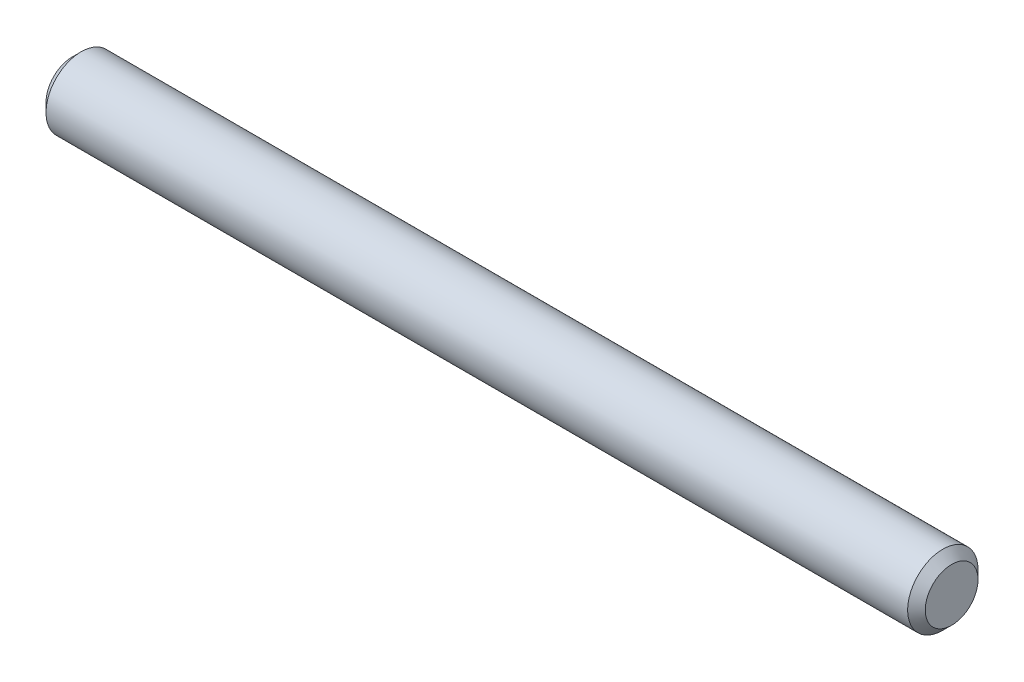
ISO-10303-21;
HEADER;
FILE_DESCRIPTION(('STEP AP214'),'2;1');
FILE_NAME('part.step','',(''),(''),'','','');
FILE_SCHEMA(('AUTOMOTIVE_DESIGN { 1 0 10303 214 1 1 1 1 }'));
ENDSEC;
DATA;
#1=APPLICATION_CONTEXT('core data for automotive mechanical design processes');
#2=APPLICATION_PROTOCOL_DEFINITION('international standard','automotive_design',2000,#1);
#3=PRODUCT_CONTEXT('',#1,'mechanical');
#4=PRODUCT('Part','Part','',(#3));
#5=PRODUCT_RELATED_PRODUCT_CATEGORY('part','',(#4));
#6=PRODUCT_DEFINITION_FORMATION('','',#4);
#7=PRODUCT_DEFINITION_CONTEXT('part definition',#1,'design');
#8=PRODUCT_DEFINITION('design','',#6,#7);
#9=PRODUCT_DEFINITION_SHAPE('','',#8);
#10=(LENGTH_UNIT() NAMED_UNIT(*) SI_UNIT(.MILLI.,.METRE.));
#11=(NAMED_UNIT(*) PLANE_ANGLE_UNIT() SI_UNIT($,.RADIAN.));
#12=(NAMED_UNIT(*) SI_UNIT($,.STERADIAN.) SOLID_ANGLE_UNIT());
#13=UNCERTAINTY_MEASURE_WITH_UNIT(LENGTH_MEASURE(1.E-05),#10,'distance_accuracy_value','');
#14=(GEOMETRIC_REPRESENTATION_CONTEXT(3) GLOBAL_UNCERTAINTY_ASSIGNED_CONTEXT((#13)) GLOBAL_UNIT_ASSIGNED_CONTEXT((#10,
#11,#12)) REPRESENTATION_CONTEXT('',''));
#15=CARTESIAN_POINT('',(0.,0.,0.));
#16=DIRECTION('',(0.,0.,1.));
#17=DIRECTION('',(1.,0.,0.));
#18=AXIS2_PLACEMENT_3D('',#15,#16,#17);
#19=CARTESIAN_POINT('',(25.,0.,0.));
#20=DIRECTION('',(-1.,0.,0.));
#21=DIRECTION('',(0.,0.,1.));
#22=AXIS2_PLACEMENT_3D('',#19,#20,#21);
#23=CYLINDRICAL_SURFACE('',#22,2.);
#24=CARTESIAN_POINT('',(-24.5,0.,0.));
#25=DIRECTION('',(1.,0.,0.));
#26=DIRECTION('',(0.,0.,-1.));
#27=AXIS2_PLACEMENT_3D('',#24,#25,#26);
#28=CIRCLE('',#27,2.);
#29=CARTESIAN_POINT('',(-24.5,0.,-2.));
#30=VERTEX_POINT('',#29);
#31=EDGE_CURVE('E48',#30,#30,#28,.T.);
#32=ORIENTED_EDGE('',*,*,#31,.T.);
#33=EDGE_LOOP('',(#32));
#34=FACE_BOUND('',#33,.T.);
#35=CARTESIAN_POINT('',(24.5,0.,0.));
#36=DIRECTION('',(1.,0.,0.));
#37=DIRECTION('',(0.,0.,-1.));
#38=AXIS2_PLACEMENT_3D('',#35,#36,#37);
#39=CIRCLE('',#38,2.);
#40=CARTESIAN_POINT('',(24.5,0.,-2.));
#41=VERTEX_POINT('',#40);
#42=EDGE_CURVE('E52',#41,#41,#39,.F.);
#43=ORIENTED_EDGE('',*,*,#42,.T.);
#44=EDGE_LOOP('',(#43));
#45=FACE_BOUND('',#44,.T.);
#46=ADVANCED_FACE('F36',(#34,#45),#23,.T.);
#47=CARTESIAN_POINT('',(25.,0.,0.));
#48=DIRECTION('',(1.,0.,0.));
#49=DIRECTION('',(0.,0.,-1.));
#50=AXIS2_PLACEMENT_3D('',#47,#48,#49);
#51=PLANE('',#50);
#52=CARTESIAN_POINT('',(25.,0.,0.));
#53=DIRECTION('',(1.,0.,0.));
#54=DIRECTION('',(0.,0.,-1.));
#55=AXIS2_PLACEMENT_3D('',#52,#53,#54);
#56=CIRCLE('',#55,1.50000000000001);
#57=CARTESIAN_POINT('',(25.,0.,-1.50000000000001));
#58=VERTEX_POINT('',#57);
#59=EDGE_CURVE('E10',#58,#58,#56,.T.);
#60=ORIENTED_EDGE('',*,*,#59,.T.);
#61=EDGE_LOOP('',(#60));
#62=FACE_BOUND('',#61,.T.);
#63=ADVANCED_FACE('F68',(#62),#51,.T.);
#64=CARTESIAN_POINT('',(-25.,0.,0.));
#65=DIRECTION('',(1.,0.,0.));
#66=DIRECTION('',(0.,0.,-1.));
#67=AXIS2_PLACEMENT_3D('',#64,#65,#66);
#68=PLANE('',#67);
#69=CARTESIAN_POINT('',(-25.,0.,0.));
#70=DIRECTION('',(1.,0.,0.));
#71=DIRECTION('',(0.,0.,-1.));
#72=AXIS2_PLACEMENT_3D('',#69,#70,#71);
#73=CIRCLE('',#72,1.49999999999999);
#74=CARTESIAN_POINT('',(-25.,0.,-1.49999999999999));
#75=VERTEX_POINT('',#74);
#76=EDGE_CURVE('E44',#75,#75,#73,.F.);
#77=ORIENTED_EDGE('',*,*,#76,.T.);
#78=EDGE_LOOP('',(#77));
#79=FACE_BOUND('',#78,.T.);
#80=ADVANCED_FACE('F65',(#79),#68,.F.);
#81=CARTESIAN_POINT('',(-24.5,0.,0.));
#82=DIRECTION('',(1.,0.,0.));
#83=DIRECTION('',(0.,0.,-1.));
#84=AXIS2_PLACEMENT_3D('',#81,#82,#83);
#85=CONICAL_SURFACE('',#84,2.,0.785398163397453);
#86=ORIENTED_EDGE('',*,*,#76,.F.);
#87=EDGE_LOOP('',(#86));
#88=FACE_BOUND('',#87,.T.);
#89=ORIENTED_EDGE('',*,*,#31,.F.);
#90=EDGE_LOOP('',(#89));
#91=FACE_BOUND('',#90,.T.);
#92=ADVANCED_FACE('F61',(#88,#91),#85,.T.);
#93=CARTESIAN_POINT('',(25.,0.,0.));
#94=DIRECTION('',(-1.,0.,0.));
#95=DIRECTION('',(0.,0.,1.));
#96=AXIS2_PLACEMENT_3D('',#93,#94,#95);
#97=CONICAL_SURFACE('',#96,1.50000000000001,0.78539816339744);
#98=ORIENTED_EDGE('',*,*,#42,.F.);
#99=EDGE_LOOP('',(#98));
#100=FACE_BOUND('',#99,.T.);
#101=ORIENTED_EDGE('',*,*,#59,.F.);
#102=EDGE_LOOP('',(#101));
#103=FACE_BOUND('',#102,.T.);
#104=ADVANCED_FACE('F39',(#100,#103),#97,.T.);
#105=CLOSED_SHELL('',(#46,#63,#80,#92,#104));
#106=MANIFOLD_SOLID_BREP('B2',#105);
#107=ADVANCED_BREP_SHAPE_REPRESENTATION('',(#18,#106),#14);
#108=SHAPE_DEFINITION_REPRESENTATION(#9,#107);
ENDSEC;
END-ISO-10303-21;
